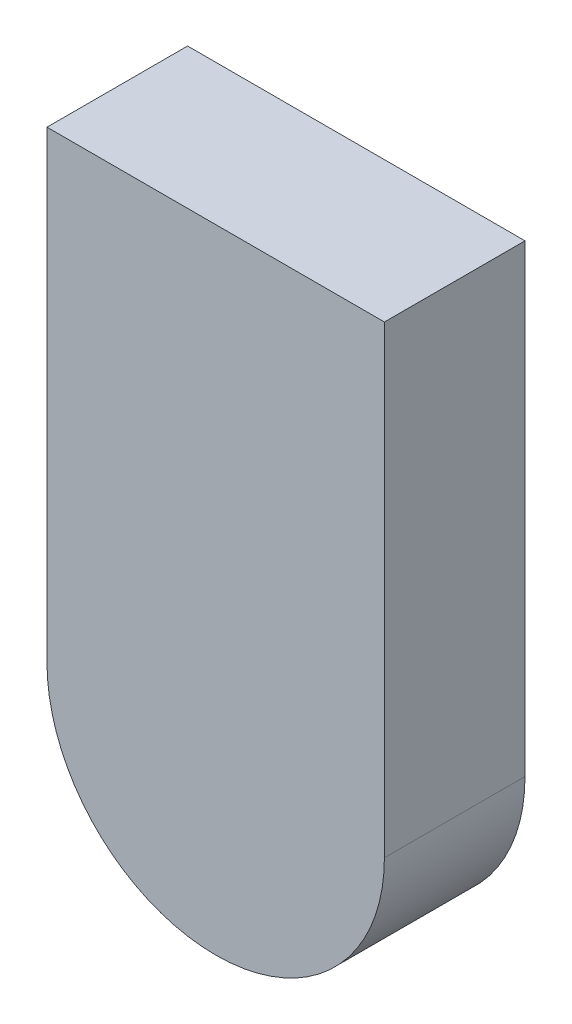
ISO-10303-21;
HEADER;
FILE_DESCRIPTION(('STEP AP214'),'2;1');
FILE_NAME('part.step','',(''),(''),'','','');
FILE_SCHEMA(('AUTOMOTIVE_DESIGN { 1 0 10303 214 1 1 1 1 }'));
ENDSEC;
DATA;
#1=APPLICATION_CONTEXT('core data for automotive mechanical design processes');
#2=APPLICATION_PROTOCOL_DEFINITION('international standard','automotive_design',2000,#1);
#3=PRODUCT_CONTEXT('',#1,'mechanical');
#4=PRODUCT('Part','Part','',(#3));
#5=PRODUCT_RELATED_PRODUCT_CATEGORY('part','',(#4));
#6=PRODUCT_DEFINITION_FORMATION('','',#4);
#7=PRODUCT_DEFINITION_CONTEXT('part definition',#1,'design');
#8=PRODUCT_DEFINITION('design','',#6,#7);
#9=PRODUCT_DEFINITION_SHAPE('','',#8);
#10=(LENGTH_UNIT() NAMED_UNIT(*) SI_UNIT(.MILLI.,.METRE.));
#11=(NAMED_UNIT(*) PLANE_ANGLE_UNIT() SI_UNIT($,.RADIAN.));
#12=(NAMED_UNIT(*) SI_UNIT($,.STERADIAN.) SOLID_ANGLE_UNIT());
#13=UNCERTAINTY_MEASURE_WITH_UNIT(LENGTH_MEASURE(1.E-05),#10,'distance_accuracy_value','');
#14=(GEOMETRIC_REPRESENTATION_CONTEXT(3) GLOBAL_UNCERTAINTY_ASSIGNED_CONTEXT((#13)) GLOBAL_UNIT_ASSIGNED_CONTEXT((#10,
#11,#12)) REPRESENTATION_CONTEXT('',''));
#15=CARTESIAN_POINT('',(0.,0.,0.));
#16=DIRECTION('',(0.,0.,1.));
#17=DIRECTION('',(1.,0.,0.));
#18=AXIS2_PLACEMENT_3D('',#15,#16,#17);
#19=CARTESIAN_POINT('',(1.13,4.05,0.));
#20=DIRECTION('',(0.,1.,0.));
#21=DIRECTION('',(1.,0.,0.));
#22=AXIS2_PLACEMENT_3D('',#19,#20,#21);
#23=PLANE('',#22);
#24=DIRECTION('',(0.,0.,1.));
#25=VECTOR('',#24,1.);
#26=CARTESIAN_POINT('',(1.13,4.05,0.));
#27=LINE('',#26,#25);
#28=CARTESIAN_POINT('',(1.13,4.05,0.));
#29=VERTEX_POINT('',#28);
#30=CARTESIAN_POINT('',(1.13,4.05,0.1));
#31=VERTEX_POINT('',#30);
#32=EDGE_CURVE('E11',#29,#31,#27,.T.);
#33=ORIENTED_EDGE('',*,*,#32,.T.);
#34=DIRECTION('',(1.,0.,0.));
#35=VECTOR('',#34,1.);
#36=CARTESIAN_POINT('',(1.13,4.05,0.1));
#37=LINE('',#36,#35);
#38=CARTESIAN_POINT('',(1.37,4.05,0.1));
#39=VERTEX_POINT('',#38);
#40=EDGE_CURVE('E24',#31,#39,#37,.T.);
#41=ORIENTED_EDGE('',*,*,#40,.T.);
#42=DIRECTION('',(0.,0.,1.));
#43=VECTOR('',#42,1.);
#44=CARTESIAN_POINT('',(1.37,4.05,0.));
#45=LINE('',#44,#43);
#46=CARTESIAN_POINT('',(1.37,4.05,0.));
#47=VERTEX_POINT('',#46);
#48=EDGE_CURVE('E85',#47,#39,#45,.T.);
#49=ORIENTED_EDGE('',*,*,#48,.F.);
#50=DIRECTION('',(1.,0.,0.));
#51=VECTOR('',#50,1.);
#52=CARTESIAN_POINT('',(1.13,4.05,0.));
#53=LINE('',#52,#51);
#54=EDGE_CURVE('E82',#29,#47,#53,.T.);
#55=ORIENTED_EDGE('',*,*,#54,.F.);
#56=EDGE_LOOP('',(#33,#41,#49,#55));
#57=FACE_BOUND('',#56,.T.);
#58=ADVANCED_FACE('F17',(#57),#23,.T.);
#59=CARTESIAN_POINT('',(1.37,4.05,0.));
#60=DIRECTION('',(1.,0.,0.));
#61=DIRECTION('',(0.,-1.,0.));
#62=AXIS2_PLACEMENT_3D('',#59,#60,#61);
#63=PLANE('',#62);
#64=ORIENTED_EDGE('',*,*,#48,.T.);
#65=DIRECTION('',(0.,-1.,0.));
#66=VECTOR('',#65,1.);
#67=CARTESIAN_POINT('',(1.37,4.05,0.1));
#68=LINE('',#67,#66);
#69=CARTESIAN_POINT('',(1.37,3.72,0.1));
#70=VERTEX_POINT('',#69);
#71=EDGE_CURVE('E80',#39,#70,#68,.T.);
#72=ORIENTED_EDGE('',*,*,#71,.T.);
#73=DIRECTION('',(0.,0.,1.));
#74=VECTOR('',#73,1.);
#75=CARTESIAN_POINT('',(1.37,3.72,0.));
#76=LINE('',#75,#74);
#77=CARTESIAN_POINT('',(1.37,3.72,0.));
#78=VERTEX_POINT('',#77);
#79=EDGE_CURVE('E60',#78,#70,#76,.T.);
#80=ORIENTED_EDGE('',*,*,#79,.F.);
#81=DIRECTION('',(0.,-1.,0.));
#82=VECTOR('',#81,1.);
#83=CARTESIAN_POINT('',(1.37,4.05,0.));
#84=LINE('',#83,#82);
#85=EDGE_CURVE('E76',#47,#78,#84,.T.);
#86=ORIENTED_EDGE('',*,*,#85,.F.);
#87=EDGE_LOOP('',(#64,#72,#80,#86));
#88=FACE_BOUND('',#87,.T.);
#89=ADVANCED_FACE('F89',(#88),#63,.T.);
#90=CARTESIAN_POINT('',(1.25,3.72,0.));
#91=DIRECTION('',(0.,0.,-1.));
#92=DIRECTION('',(1.,0.,0.));
#93=AXIS2_PLACEMENT_3D('',#90,#91,#92);
#94=CYLINDRICAL_SURFACE('',#93,0.12);
#95=CARTESIAN_POINT('',(1.25,3.72,0.));
#96=DIRECTION('',(0.,0.,1.));
#97=DIRECTION('',(1.,0.,0.));
#98=AXIS2_PLACEMENT_3D('',#95,#96,#97);
#99=CIRCLE('',#98,0.12);
#100=CARTESIAN_POINT('',(1.13,3.72,0.));
#101=VERTEX_POINT('',#100);
#102=EDGE_CURVE('E64',#101,#78,#99,.T.);
#103=ORIENTED_EDGE('',*,*,#102,.T.);
#104=ORIENTED_EDGE('',*,*,#79,.T.);
#105=CARTESIAN_POINT('',(1.25,3.72,0.1));
#106=DIRECTION('',(0.,0.,1.));
#107=DIRECTION('',(1.,0.,0.));
#108=AXIS2_PLACEMENT_3D('',#105,#106,#107);
#109=CIRCLE('',#108,0.12);
#110=CARTESIAN_POINT('',(1.13,3.72,0.1));
#111=VERTEX_POINT('',#110);
#112=EDGE_CURVE('E55',#111,#70,#109,.T.);
#113=ORIENTED_EDGE('',*,*,#112,.F.);
#114=DIRECTION('',(0.,0.,1.));
#115=VECTOR('',#114,1.);
#116=CARTESIAN_POINT('',(1.13,3.72,0.));
#117=LINE('',#116,#115);
#118=EDGE_CURVE('E59',#101,#111,#117,.T.);
#119=ORIENTED_EDGE('',*,*,#118,.F.);
#120=EDGE_LOOP('',(#103,#104,#113,#119));
#121=FACE_BOUND('',#120,.T.);
#122=ADVANCED_FACE('F58',(#121),#94,.T.);
#123=CARTESIAN_POINT('',(1.13,4.05,0.));
#124=DIRECTION('',(1.,0.,0.));
#125=DIRECTION('',(0.,-1.,0.));
#126=AXIS2_PLACEMENT_3D('',#123,#124,#125);
#127=PLANE('',#126);
#128=DIRECTION('',(0.,-1.,0.));
#129=VECTOR('',#128,1.);
#130=CARTESIAN_POINT('',(1.13,4.05,0.));
#131=LINE('',#130,#129);
#132=EDGE_CURVE('E69',#29,#101,#131,.T.);
#133=ORIENTED_EDGE('',*,*,#132,.T.);
#134=ORIENTED_EDGE('',*,*,#118,.T.);
#135=DIRECTION('',(0.,-1.,0.));
#136=VECTOR('',#135,1.);
#137=CARTESIAN_POINT('',(1.13,4.05,0.1));
#138=LINE('',#137,#136);
#139=EDGE_CURVE('E67',#31,#111,#138,.T.);
#140=ORIENTED_EDGE('',*,*,#139,.F.);
#141=ORIENTED_EDGE('',*,*,#32,.F.);
#142=EDGE_LOOP('',(#133,#134,#140,#141));
#143=FACE_BOUND('',#142,.T.);
#144=ADVANCED_FACE('F66',(#143),#127,.F.);
#145=CARTESIAN_POINT('',(1.25,3.849490847913,0.));
#146=DIRECTION('',(0.,0.,-1.));
#147=DIRECTION('',(-1.,0.,0.));
#148=AXIS2_PLACEMENT_3D('',#145,#146,#147);
#149=PLANE('',#148);
#150=ORIENTED_EDGE('',*,*,#54,.T.);
#151=ORIENTED_EDGE('',*,*,#85,.T.);
#152=ORIENTED_EDGE('',*,*,#102,.F.);
#153=ORIENTED_EDGE('',*,*,#132,.F.);
#154=EDGE_LOOP('',(#150,#151,#152,#153));
#155=FACE_BOUND('',#154,.T.);
#156=ADVANCED_FACE('F91',(#155),#149,.T.);
#157=CARTESIAN_POINT('',(1.25,3.849490847913,0.1));
#158=DIRECTION('',(0.,0.,-1.));
#159=DIRECTION('',(-1.,0.,0.));
#160=AXIS2_PLACEMENT_3D('',#157,#158,#159);
#161=PLANE('',#160);
#162=ORIENTED_EDGE('',*,*,#139,.T.);
#163=ORIENTED_EDGE('',*,*,#112,.T.);
#164=ORIENTED_EDGE('',*,*,#71,.F.);
#165=ORIENTED_EDGE('',*,*,#40,.F.);
#166=EDGE_LOOP('',(#162,#163,#164,#165));
#167=FACE_BOUND('',#166,.T.);
#168=ADVANCED_FACE('F71',(#167),#161,.F.);
#169=CLOSED_SHELL('',(#58,#89,#122,#144,#156,#168));
#170=MANIFOLD_SOLID_BREP('B1',#169);
#171=ADVANCED_BREP_SHAPE_REPRESENTATION('',(#18,#170),#14);
#172=SHAPE_DEFINITION_REPRESENTATION(#9,#171);
ENDSEC;
END-ISO-10303-21;
